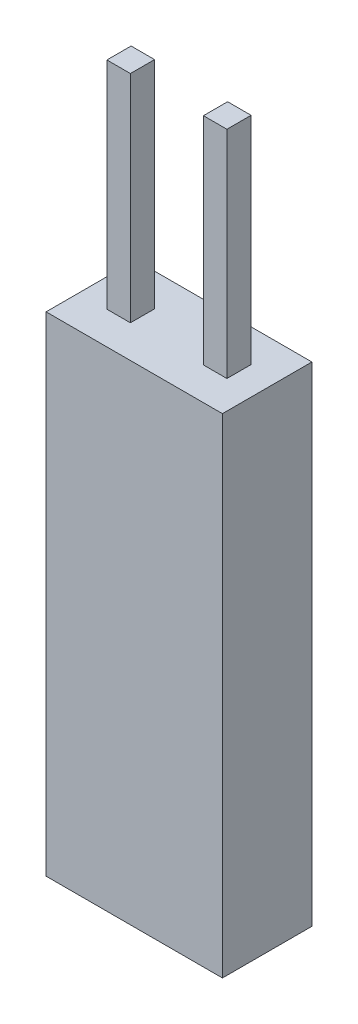
ISO-10303-21;
HEADER;
FILE_DESCRIPTION(('STEP AP214'),'2;1');
FILE_NAME('part.step','',(''),(''),'','','');
FILE_SCHEMA(('AUTOMOTIVE_DESIGN { 1 0 10303 214 1 1 1 1 }'));
ENDSEC;
DATA;
#1=APPLICATION_CONTEXT('core data for automotive mechanical design processes');
#2=APPLICATION_PROTOCOL_DEFINITION('international standard','automotive_design',2000,#1);
#3=PRODUCT_CONTEXT('',#1,'mechanical');
#4=PRODUCT('Part','Part','',(#3));
#5=PRODUCT_RELATED_PRODUCT_CATEGORY('part','',(#4));
#6=PRODUCT_DEFINITION_FORMATION('','',#4);
#7=PRODUCT_DEFINITION_CONTEXT('part definition',#1,'design');
#8=PRODUCT_DEFINITION('design','',#6,#7);
#9=PRODUCT_DEFINITION_SHAPE('','',#8);
#10=(LENGTH_UNIT() NAMED_UNIT(*) SI_UNIT(.MILLI.,.METRE.));
#11=(NAMED_UNIT(*) PLANE_ANGLE_UNIT() SI_UNIT($,.RADIAN.));
#12=(NAMED_UNIT(*) SI_UNIT($,.STERADIAN.) SOLID_ANGLE_UNIT());
#13=UNCERTAINTY_MEASURE_WITH_UNIT(LENGTH_MEASURE(1.E-05),#10,'distance_accuracy_value','');
#14=(GEOMETRIC_REPRESENTATION_CONTEXT(3) GLOBAL_UNCERTAINTY_ASSIGNED_CONTEXT((#13)) GLOBAL_UNIT_ASSIGNED_CONTEXT((#10,
#11,#12)) REPRESENTATION_CONTEXT('',''));
#15=CARTESIAN_POINT('',(0.,0.,0.));
#16=DIRECTION('',(0.,0.,1.));
#17=DIRECTION('',(1.,0.,0.));
#18=AXIS2_PLACEMENT_3D('',#15,#16,#17);
#19=CARTESIAN_POINT('',(0.,0.,0.));
#20=DIRECTION('',(0.,-1.,0.));
#21=DIRECTION('',(0.,0.,-1.));
#22=AXIS2_PLACEMENT_3D('',#19,#20,#21);
#23=PLANE('',#22);
#24=DIRECTION('',(0.,0.,-1.));
#25=VECTOR('',#24,1.);
#26=CARTESIAN_POINT('',(-1.057,0.,0.35));
#27=LINE('',#26,#25);
#28=CARTESIAN_POINT('',(-1.057,0.,0.35));
#29=VERTEX_POINT('',#28);
#30=CARTESIAN_POINT('',(-1.057,0.,-0.35));
#31=VERTEX_POINT('',#30);
#32=EDGE_CURVE('E178',#29,#31,#27,.T.);
#33=ORIENTED_EDGE('',*,*,#32,.F.);
#34=DIRECTION('',(1.,0.,0.));
#35=VECTOR('',#34,1.);
#36=CARTESIAN_POINT('',(-1.737,0.,0.35));
#37=LINE('',#36,#35);
#38=CARTESIAN_POINT('',(-1.737,0.,0.35));
#39=VERTEX_POINT('',#38);
#40=EDGE_CURVE('E195',#39,#29,#37,.T.);
#41=ORIENTED_EDGE('',*,*,#40,.F.);
#42=DIRECTION('',(0.,0.,1.));
#43=VECTOR('',#42,1.);
#44=CARTESIAN_POINT('',(-1.737,0.,0.35));
#45=LINE('',#44,#43);
#46=CARTESIAN_POINT('',(-1.737,0.,-0.35));
#47=VERTEX_POINT('',#46);
#48=EDGE_CURVE('E208',#47,#39,#45,.T.);
#49=ORIENTED_EDGE('',*,*,#48,.F.);
#50=DIRECTION('',(-1.,0.,0.));
#51=VECTOR('',#50,1.);
#52=CARTESIAN_POINT('',(-1.737,0.,-0.35));
#53=LINE('',#52,#51);
#54=EDGE_CURVE('E183',#31,#47,#53,.T.);
#55=ORIENTED_EDGE('',*,*,#54,.F.);
#56=EDGE_LOOP('',(#33,#41,#49,#55));
#57=FACE_BOUND('',#56,.T.);
#58=DIRECTION('',(0.,0.,1.));
#59=VECTOR('',#58,1.);
#60=CARTESIAN_POINT('',(-2.5527,0.,-1.2954));
#61=LINE('',#60,#59);
#62=CARTESIAN_POINT('',(-2.5527,0.,-1.2954));
#63=VERTEX_POINT('',#62);
#64=CARTESIAN_POINT('',(-2.5527,0.,1.2954));
#65=VERTEX_POINT('',#64);
#66=EDGE_CURVE('E230',#63,#65,#61,.T.);
#67=ORIENTED_EDGE('',*,*,#66,.T.);
#68=DIRECTION('',(1.,0.,0.));
#69=VECTOR('',#68,1.);
#70=CARTESIAN_POINT('',(2.5527,0.,1.2954));
#71=LINE('',#70,#69);
#72=CARTESIAN_POINT('',(2.5527,0.,1.2954));
#73=VERTEX_POINT('',#72);
#74=EDGE_CURVE('E251',#65,#73,#71,.T.);
#75=ORIENTED_EDGE('',*,*,#74,.T.);
#76=DIRECTION('',(0.,0.,-1.));
#77=VECTOR('',#76,1.);
#78=CARTESIAN_POINT('',(2.5527,0.,-1.2954));
#79=LINE('',#78,#77);
#80=CARTESIAN_POINT('',(2.5527,0.,-1.2954));
#81=VERTEX_POINT('',#80);
#82=EDGE_CURVE('E255',#73,#81,#79,.T.);
#83=ORIENTED_EDGE('',*,*,#82,.T.);
#84=DIRECTION('',(-1.,0.,0.));
#85=VECTOR('',#84,1.);
#86=CARTESIAN_POINT('',(2.5527,0.,-1.2954));
#87=LINE('',#86,#85);
#88=EDGE_CURVE('E236',#81,#63,#87,.T.);
#89=ORIENTED_EDGE('',*,*,#88,.T.);
#90=EDGE_LOOP('',(#67,#75,#83,#89));
#91=FACE_BOUND('',#90,.T.);
#92=DIRECTION('',(1.,0.,0.));
#93=VECTOR('',#92,1.);
#94=CARTESIAN_POINT('',(1.737,0.,0.35));
#95=LINE('',#94,#93);
#96=CARTESIAN_POINT('',(1.057,0.,0.35));
#97=VERTEX_POINT('',#96);
#98=CARTESIAN_POINT('',(1.737,0.,0.35));
#99=VERTEX_POINT('',#98);
#100=EDGE_CURVE('E176',#97,#99,#95,.T.);
#101=ORIENTED_EDGE('',*,*,#100,.F.);
#102=DIRECTION('',(0.,0.,1.));
#103=VECTOR('',#102,1.);
#104=CARTESIAN_POINT('',(1.057,0.,0.35));
#105=LINE('',#104,#103);
#106=CARTESIAN_POINT('',(1.057,0.,-0.35));
#107=VERTEX_POINT('',#106);
#108=EDGE_CURVE('E173',#107,#97,#105,.T.);
#109=ORIENTED_EDGE('',*,*,#108,.F.);
#110=DIRECTION('',(-1.,0.,0.));
#111=VECTOR('',#110,1.);
#112=CARTESIAN_POINT('',(1.737,0.,-0.35));
#113=LINE('',#112,#111);
#114=CARTESIAN_POINT('',(1.737,0.,-0.35));
#115=VERTEX_POINT('',#114);
#116=EDGE_CURVE('E66',#115,#107,#113,.T.);
#117=ORIENTED_EDGE('',*,*,#116,.F.);
#118=DIRECTION('',(0.,0.,-1.));
#119=VECTOR('',#118,1.);
#120=CARTESIAN_POINT('',(1.737,0.,0.35));
#121=LINE('',#120,#119);
#122=EDGE_CURVE('E60',#99,#115,#121,.T.);
#123=ORIENTED_EDGE('',*,*,#122,.F.);
#124=EDGE_LOOP('',(#101,#109,#117,#123));
#125=FACE_BOUND('',#124,.T.);
#126=ADVANCED_FACE('F39',(#57,#91,#125),#23,.F.);
#127=CARTESIAN_POINT('',(-2.5527,-14.15,-1.2954));
#128=DIRECTION('',(-1.,0.,0.));
#129=DIRECTION('',(0.,0.,1.));
#130=AXIS2_PLACEMENT_3D('',#127,#128,#129);
#131=PLANE('',#130);
#132=ORIENTED_EDGE('',*,*,#66,.F.);
#133=DIRECTION('',(0.,1.,0.));
#134=VECTOR('',#133,1.);
#135=CARTESIAN_POINT('',(-2.5527,-14.15,-1.2954));
#136=LINE('',#135,#134);
#137=CARTESIAN_POINT('',(-2.5527,-14.15,-1.2954));
#138=VERTEX_POINT('',#137);
#139=EDGE_CURVE('E11',#138,#63,#136,.T.);
#140=ORIENTED_EDGE('',*,*,#139,.F.);
#141=DIRECTION('',(0.,0.,1.));
#142=VECTOR('',#141,1.);
#143=CARTESIAN_POINT('',(-2.5527,-14.15,-1.2954));
#144=LINE('',#143,#142);
#145=CARTESIAN_POINT('',(-2.5527,-14.15,1.2954));
#146=VERTEX_POINT('',#145);
#147=EDGE_CURVE('E231',#138,#146,#144,.T.);
#148=ORIENTED_EDGE('',*,*,#147,.T.);
#149=DIRECTION('',(0.,1.,0.));
#150=VECTOR('',#149,1.);
#151=CARTESIAN_POINT('',(-2.5527,-14.15,1.2954));
#152=LINE('',#151,#150);
#153=EDGE_CURVE('E43',#146,#65,#152,.T.);
#154=ORIENTED_EDGE('',*,*,#153,.T.);
#155=EDGE_LOOP('',(#132,#140,#148,#154));
#156=FACE_BOUND('',#155,.T.);
#157=ADVANCED_FACE('F41',(#156),#131,.T.);
#158=CARTESIAN_POINT('',(2.5527,-14.15,-1.2954));
#159=DIRECTION('',(0.,0.,-1.));
#160=DIRECTION('',(-1.,0.,0.));
#161=AXIS2_PLACEMENT_3D('',#158,#159,#160);
#162=PLANE('',#161);
#163=ORIENTED_EDGE('',*,*,#88,.F.);
#164=DIRECTION('',(0.,1.,0.));
#165=VECTOR('',#164,1.);
#166=CARTESIAN_POINT('',(2.5527,-14.15,-1.2954));
#167=LINE('',#166,#165);
#168=CARTESIAN_POINT('',(2.5527,-14.15,-1.2954));
#169=VERTEX_POINT('',#168);
#170=EDGE_CURVE('E49',#169,#81,#167,.T.);
#171=ORIENTED_EDGE('',*,*,#170,.F.);
#172=DIRECTION('',(-1.,0.,0.));
#173=VECTOR('',#172,1.);
#174=CARTESIAN_POINT('',(2.5527,-14.15,-1.2954));
#175=LINE('',#174,#173);
#176=EDGE_CURVE('E244',#169,#138,#175,.T.);
#177=ORIENTED_EDGE('',*,*,#176,.T.);
#178=ORIENTED_EDGE('',*,*,#139,.T.);
#179=EDGE_LOOP('',(#163,#171,#177,#178));
#180=FACE_BOUND('',#179,.T.);
#181=ADVANCED_FACE('F278',(#180),#162,.T.);
#182=CARTESIAN_POINT('',(2.5527,-14.15,-1.2954));
#183=DIRECTION('',(1.,0.,0.));
#184=DIRECTION('',(0.,0.,-1.));
#185=AXIS2_PLACEMENT_3D('',#182,#183,#184);
#186=PLANE('',#185);
#187=ORIENTED_EDGE('',*,*,#82,.F.);
#188=DIRECTION('',(0.,1.,0.));
#189=VECTOR('',#188,1.);
#190=CARTESIAN_POINT('',(2.5527,-14.15,1.2954));
#191=LINE('',#190,#189);
#192=CARTESIAN_POINT('',(2.5527,-14.15,1.2954));
#193=VERTEX_POINT('',#192);
#194=EDGE_CURVE('E263',#193,#73,#191,.T.);
#195=ORIENTED_EDGE('',*,*,#194,.F.);
#196=DIRECTION('',(0.,0.,-1.));
#197=VECTOR('',#196,1.);
#198=CARTESIAN_POINT('',(2.5527,-14.15,-1.2954));
#199=LINE('',#198,#197);
#200=EDGE_CURVE('E240',#193,#169,#199,.T.);
#201=ORIENTED_EDGE('',*,*,#200,.T.);
#202=ORIENTED_EDGE('',*,*,#170,.T.);
#203=EDGE_LOOP('',(#187,#195,#201,#202));
#204=FACE_BOUND('',#203,.T.);
#205=ADVANCED_FACE('F284',(#204),#186,.T.);
#206=CARTESIAN_POINT('',(2.5527,-14.15,1.2954));
#207=DIRECTION('',(0.,0.,1.));
#208=DIRECTION('',(1.,0.,0.));
#209=AXIS2_PLACEMENT_3D('',#206,#207,#208);
#210=PLANE('',#209);
#211=ORIENTED_EDGE('',*,*,#74,.F.);
#212=ORIENTED_EDGE('',*,*,#153,.F.);
#213=DIRECTION('',(1.,0.,0.));
#214=VECTOR('',#213,1.);
#215=CARTESIAN_POINT('',(2.5527,-14.15,1.2954));
#216=LINE('',#215,#214);
#217=EDGE_CURVE('E235',#146,#193,#216,.T.);
#218=ORIENTED_EDGE('',*,*,#217,.T.);
#219=ORIENTED_EDGE('',*,*,#194,.T.);
#220=EDGE_LOOP('',(#211,#212,#218,#219));
#221=FACE_BOUND('',#220,.T.);
#222=ADVANCED_FACE('F274',(#221),#210,.T.);
#223=CARTESIAN_POINT('',(0.,-14.15,0.));
#224=DIRECTION('',(0.,-1.,0.));
#225=DIRECTION('',(0.,0.,-1.));
#226=AXIS2_PLACEMENT_3D('',#223,#224,#225);
#227=PLANE('',#226);
#228=ORIENTED_EDGE('',*,*,#147,.F.);
#229=ORIENTED_EDGE('',*,*,#176,.F.);
#230=ORIENTED_EDGE('',*,*,#200,.F.);
#231=ORIENTED_EDGE('',*,*,#217,.F.);
#232=EDGE_LOOP('',(#228,#229,#230,#231));
#233=FACE_BOUND('',#232,.T.);
#234=ADVANCED_FACE('F281',(#233),#227,.T.);
#235=CARTESIAN_POINT('',(-1.057,6.25,0.35));
#236=DIRECTION('',(-1.,0.,0.));
#237=DIRECTION('',(0.,0.,1.));
#238=AXIS2_PLACEMENT_3D('',#235,#236,#237);
#239=PLANE('',#238);
#240=ORIENTED_EDGE('',*,*,#32,.T.);
#241=DIRECTION('',(0.,-1.,0.));
#242=VECTOR('',#241,1.);
#243=CARTESIAN_POINT('',(-1.057,6.25,-0.35));
#244=LINE('',#243,#242);
#245=CARTESIAN_POINT('',(-1.057,6.25,-0.35));
#246=VERTEX_POINT('',#245);
#247=EDGE_CURVE('E226',#246,#31,#244,.T.);
#248=ORIENTED_EDGE('',*,*,#247,.F.);
#249=DIRECTION('',(0.,0.,-1.));
#250=VECTOR('',#249,1.);
#251=CARTESIAN_POINT('',(-1.057,6.25,0.35));
#252=LINE('',#251,#250);
#253=CARTESIAN_POINT('',(-1.057,6.25,0.35));
#254=VERTEX_POINT('',#253);
#255=EDGE_CURVE('E190',#254,#246,#252,.T.);
#256=ORIENTED_EDGE('',*,*,#255,.F.);
#257=DIRECTION('',(0.,-1.,0.));
#258=VECTOR('',#257,1.);
#259=CARTESIAN_POINT('',(-1.057,6.25,0.35));
#260=LINE('',#259,#258);
#261=EDGE_CURVE('E203',#254,#29,#260,.T.);
#262=ORIENTED_EDGE('',*,*,#261,.T.);
#263=EDGE_LOOP('',(#240,#248,#256,#262));
#264=FACE_BOUND('',#263,.T.);
#265=ADVANCED_FACE('F301',(#264),#239,.F.);
#266=CARTESIAN_POINT('',(-1.737,6.25,-0.35));
#267=DIRECTION('',(0.,0.,1.));
#268=DIRECTION('',(1.,0.,0.));
#269=AXIS2_PLACEMENT_3D('',#266,#267,#268);
#270=PLANE('',#269);
#271=ORIENTED_EDGE('',*,*,#54,.T.);
#272=DIRECTION('',(0.,-1.,0.));
#273=VECTOR('',#272,1.);
#274=CARTESIAN_POINT('',(-1.737,6.25,-0.35));
#275=LINE('',#274,#273);
#276=CARTESIAN_POINT('',(-1.737,6.25,-0.35));
#277=VERTEX_POINT('',#276);
#278=EDGE_CURVE('E222',#277,#47,#275,.T.);
#279=ORIENTED_EDGE('',*,*,#278,.F.);
#280=DIRECTION('',(-1.,0.,0.));
#281=VECTOR('',#280,1.);
#282=CARTESIAN_POINT('',(-1.737,6.25,-0.35));
#283=LINE('',#282,#281);
#284=EDGE_CURVE('E194',#246,#277,#283,.T.);
#285=ORIENTED_EDGE('',*,*,#284,.F.);
#286=ORIENTED_EDGE('',*,*,#247,.T.);
#287=EDGE_LOOP('',(#271,#279,#285,#286));
#288=FACE_BOUND('',#287,.T.);
#289=ADVANCED_FACE('F304',(#288),#270,.F.);
#290=CARTESIAN_POINT('',(-1.737,6.25,0.35));
#291=DIRECTION('',(1.,0.,0.));
#292=DIRECTION('',(0.,0.,-1.));
#293=AXIS2_PLACEMENT_3D('',#290,#291,#292);
#294=PLANE('',#293);
#295=ORIENTED_EDGE('',*,*,#48,.T.);
#296=DIRECTION('',(0.,-1.,0.));
#297=VECTOR('',#296,1.);
#298=CARTESIAN_POINT('',(-1.737,6.25,0.35));
#299=LINE('',#298,#297);
#300=CARTESIAN_POINT('',(-1.737,6.25,0.35));
#301=VERTEX_POINT('',#300);
#302=EDGE_CURVE('E218',#301,#39,#299,.T.);
#303=ORIENTED_EDGE('',*,*,#302,.F.);
#304=DIRECTION('',(0.,0.,1.));
#305=VECTOR('',#304,1.);
#306=CARTESIAN_POINT('',(-1.737,6.25,0.35));
#307=LINE('',#306,#305);
#308=EDGE_CURVE('E198',#277,#301,#307,.T.);
#309=ORIENTED_EDGE('',*,*,#308,.F.);
#310=ORIENTED_EDGE('',*,*,#278,.T.);
#311=EDGE_LOOP('',(#295,#303,#309,#310));
#312=FACE_BOUND('',#311,.T.);
#313=ADVANCED_FACE('F308',(#312),#294,.F.);
#314=CARTESIAN_POINT('',(-1.737,6.25,0.35));
#315=DIRECTION('',(0.,0.,-1.));
#316=DIRECTION('',(-1.,0.,0.));
#317=AXIS2_PLACEMENT_3D('',#314,#315,#316);
#318=PLANE('',#317);
#319=ORIENTED_EDGE('',*,*,#40,.T.);
#320=ORIENTED_EDGE('',*,*,#261,.F.);
#321=DIRECTION('',(1.,0.,0.));
#322=VECTOR('',#321,1.);
#323=CARTESIAN_POINT('',(-1.737,6.25,0.35));
#324=LINE('',#323,#322);
#325=EDGE_CURVE('E201',#301,#254,#324,.T.);
#326=ORIENTED_EDGE('',*,*,#325,.F.);
#327=ORIENTED_EDGE('',*,*,#302,.T.);
#328=EDGE_LOOP('',(#319,#320,#326,#327));
#329=FACE_BOUND('',#328,.T.);
#330=ADVANCED_FACE('F312',(#329),#318,.F.);
#331=CARTESIAN_POINT('',(0.,6.25,0.));
#332=DIRECTION('',(0.,-1.,0.));
#333=DIRECTION('',(0.,0.,-1.));
#334=AXIS2_PLACEMENT_3D('',#331,#332,#333);
#335=PLANE('',#334);
#336=ORIENTED_EDGE('',*,*,#255,.T.);
#337=ORIENTED_EDGE('',*,*,#284,.T.);
#338=ORIENTED_EDGE('',*,*,#308,.T.);
#339=ORIENTED_EDGE('',*,*,#325,.T.);
#340=EDGE_LOOP('',(#336,#337,#338,#339));
#341=FACE_BOUND('',#340,.T.);
#342=ADVANCED_FACE('F316',(#341),#335,.F.);
#343=CARTESIAN_POINT('',(1.737,6.25,0.35));
#344=DIRECTION('',(0.,0.,-1.));
#345=DIRECTION('',(-1.,0.,0.));
#346=AXIS2_PLACEMENT_3D('',#343,#344,#345);
#347=PLANE('',#346);
#348=ORIENTED_EDGE('',*,*,#100,.T.);
#349=DIRECTION('',(0.,-1.,0.));
#350=VECTOR('',#349,1.);
#351=CARTESIAN_POINT('',(1.737,6.25,0.35));
#352=LINE('',#351,#350);
#353=CARTESIAN_POINT('',(1.737,6.25,0.35));
#354=VERTEX_POINT('',#353);
#355=EDGE_CURVE('E155',#354,#99,#352,.T.);
#356=ORIENTED_EDGE('',*,*,#355,.F.);
#357=DIRECTION('',(1.,0.,0.));
#358=VECTOR('',#357,1.);
#359=CARTESIAN_POINT('',(1.737,6.25,0.35));
#360=LINE('',#359,#358);
#361=CARTESIAN_POINT('',(1.057,6.25,0.35));
#362=VERTEX_POINT('',#361);
#363=EDGE_CURVE('E163',#362,#354,#360,.T.);
#364=ORIENTED_EDGE('',*,*,#363,.F.);
#365=DIRECTION('',(0.,-1.,0.));
#366=VECTOR('',#365,1.);
#367=CARTESIAN_POINT('',(1.057,6.25,0.35));
#368=LINE('',#367,#366);
#369=EDGE_CURVE('E438',#362,#97,#368,.T.);
#370=ORIENTED_EDGE('',*,*,#369,.T.);
#371=EDGE_LOOP('',(#348,#356,#364,#370));
#372=FACE_BOUND('',#371,.T.);
#373=ADVANCED_FACE('F175',(#372),#347,.F.);
#374=CARTESIAN_POINT('',(1.737,6.25,0.35));
#375=DIRECTION('',(-1.,0.,0.));
#376=DIRECTION('',(0.,0.,1.));
#377=AXIS2_PLACEMENT_3D('',#374,#375,#376);
#378=PLANE('',#377);
#379=ORIENTED_EDGE('',*,*,#122,.T.);
#380=DIRECTION('',(0.,-1.,0.));
#381=VECTOR('',#380,1.);
#382=CARTESIAN_POINT('',(1.737,6.25,-0.35));
#383=LINE('',#382,#381);
#384=CARTESIAN_POINT('',(1.737,6.25,-0.35));
#385=VERTEX_POINT('',#384);
#386=EDGE_CURVE('E158',#385,#115,#383,.T.);
#387=ORIENTED_EDGE('',*,*,#386,.F.);
#388=DIRECTION('',(0.,0.,-1.));
#389=VECTOR('',#388,1.);
#390=CARTESIAN_POINT('',(1.737,6.25,0.35));
#391=LINE('',#390,#389);
#392=EDGE_CURVE('E151',#354,#385,#391,.T.);
#393=ORIENTED_EDGE('',*,*,#392,.F.);
#394=ORIENTED_EDGE('',*,*,#355,.T.);
#395=EDGE_LOOP('',(#379,#387,#393,#394));
#396=FACE_BOUND('',#395,.T.);
#397=ADVANCED_FACE('F153',(#396),#378,.F.);
#398=CARTESIAN_POINT('',(1.737,6.25,-0.35));
#399=DIRECTION('',(0.,0.,1.));
#400=DIRECTION('',(1.,0.,0.));
#401=AXIS2_PLACEMENT_3D('',#398,#399,#400);
#402=PLANE('',#401);
#403=ORIENTED_EDGE('',*,*,#116,.T.);
#404=DIRECTION('',(0.,-1.,0.));
#405=VECTOR('',#404,1.);
#406=CARTESIAN_POINT('',(1.057,6.25,-0.35));
#407=LINE('',#406,#405);
#408=CARTESIAN_POINT('',(1.057,6.25,-0.35));
#409=VERTEX_POINT('',#408);
#410=EDGE_CURVE('E186',#409,#107,#407,.T.);
#411=ORIENTED_EDGE('',*,*,#410,.F.);
#412=DIRECTION('',(-1.,0.,0.));
#413=VECTOR('',#412,1.);
#414=CARTESIAN_POINT('',(1.737,6.25,-0.35));
#415=LINE('',#414,#413);
#416=EDGE_CURVE('E162',#385,#409,#415,.T.);
#417=ORIENTED_EDGE('',*,*,#416,.F.);
#418=ORIENTED_EDGE('',*,*,#386,.T.);
#419=EDGE_LOOP('',(#403,#411,#417,#418));
#420=FACE_BOUND('',#419,.T.);
#421=ADVANCED_FACE('F325',(#420),#402,.F.);
#422=CARTESIAN_POINT('',(1.057,6.25,0.35));
#423=DIRECTION('',(1.,0.,0.));
#424=DIRECTION('',(0.,0.,-1.));
#425=AXIS2_PLACEMENT_3D('',#422,#423,#424);
#426=PLANE('',#425);
#427=ORIENTED_EDGE('',*,*,#108,.T.);
#428=ORIENTED_EDGE('',*,*,#369,.F.);
#429=DIRECTION('',(0.,0.,1.));
#430=VECTOR('',#429,1.);
#431=CARTESIAN_POINT('',(1.057,6.25,0.35));
#432=LINE('',#431,#430);
#433=EDGE_CURVE('E168',#409,#362,#432,.T.);
#434=ORIENTED_EDGE('',*,*,#433,.F.);
#435=ORIENTED_EDGE('',*,*,#410,.T.);
#436=EDGE_LOOP('',(#427,#428,#434,#435));
#437=FACE_BOUND('',#436,.T.);
#438=ADVANCED_FACE('F328',(#437),#426,.F.);
#439=CARTESIAN_POINT('',(0.,6.25,0.));
#440=DIRECTION('',(0.,-1.,0.));
#441=DIRECTION('',(0.,0.,-1.));
#442=AXIS2_PLACEMENT_3D('',#439,#440,#441);
#443=PLANE('',#442);
#444=ORIENTED_EDGE('',*,*,#363,.T.);
#445=ORIENTED_EDGE('',*,*,#392,.T.);
#446=ORIENTED_EDGE('',*,*,#416,.T.);
#447=ORIENTED_EDGE('',*,*,#433,.T.);
#448=EDGE_LOOP('',(#444,#445,#446,#447));
#449=FACE_BOUND('',#448,.T.);
#450=ADVANCED_FACE('F166',(#449),#443,.F.);
#451=CLOSED_SHELL('',(#126,#157,#181,#205,#222,#234,#265,#289,#313,#330,#342,#373,#397,#421,
#438,#450));
#452=MANIFOLD_SOLID_BREP('B2',#451);
#453=ADVANCED_BREP_SHAPE_REPRESENTATION('',(#18,#452),#14);
#454=SHAPE_DEFINITION_REPRESENTATION(#9,#453);
ENDSEC;
END-ISO-10303-21;
